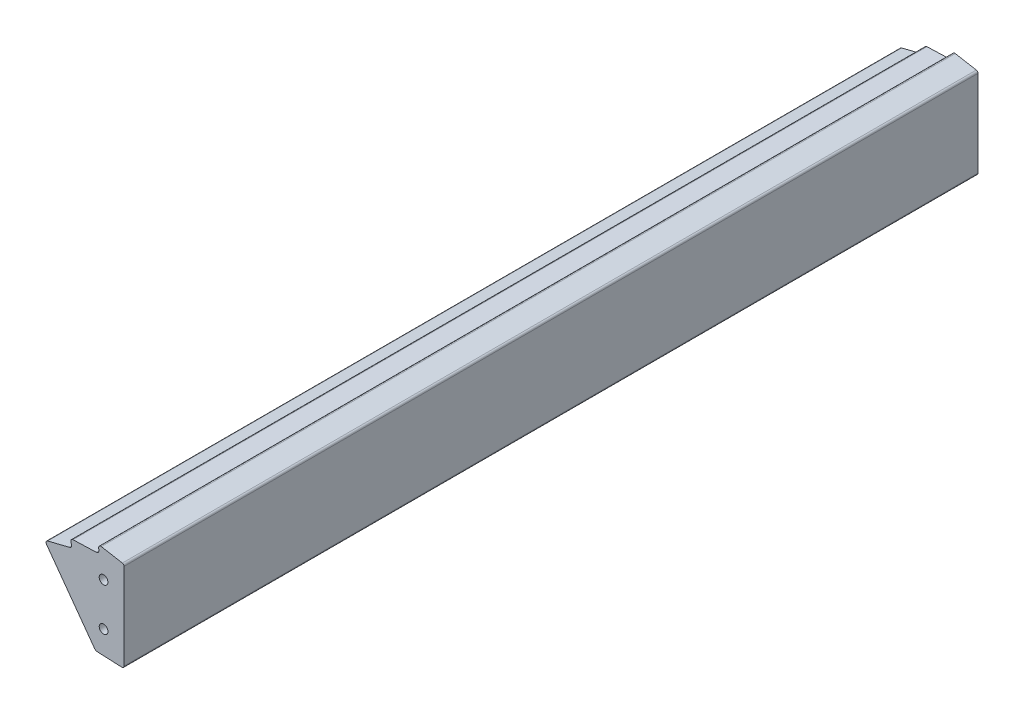
ISO-10303-21;
HEADER;
FILE_DESCRIPTION(('STEP AP214'),'2;1');
FILE_NAME('part.step','',(''),(''),'','','');
FILE_SCHEMA(('AUTOMOTIVE_DESIGN { 1 0 10303 214 1 1 1 1 }'));
ENDSEC;
DATA;
#1=APPLICATION_CONTEXT('core data for automotive mechanical design processes');
#2=APPLICATION_PROTOCOL_DEFINITION('international standard','automotive_design',2000,#1);
#3=PRODUCT_CONTEXT('',#1,'mechanical');
#4=PRODUCT('Part','Part','',(#3));
#5=PRODUCT_RELATED_PRODUCT_CATEGORY('part','',(#4));
#6=PRODUCT_DEFINITION_FORMATION('','',#4);
#7=PRODUCT_DEFINITION_CONTEXT('part definition',#1,'design');
#8=PRODUCT_DEFINITION('design','',#6,#7);
#9=PRODUCT_DEFINITION_SHAPE('','',#8);
#10=(LENGTH_UNIT() NAMED_UNIT(*) SI_UNIT(.MILLI.,.METRE.));
#11=(NAMED_UNIT(*) PLANE_ANGLE_UNIT() SI_UNIT($,.RADIAN.));
#12=(NAMED_UNIT(*) SI_UNIT($,.STERADIAN.) SOLID_ANGLE_UNIT());
#13=UNCERTAINTY_MEASURE_WITH_UNIT(LENGTH_MEASURE(1.E-05),#10,'distance_accuracy_value','');
#14=(GEOMETRIC_REPRESENTATION_CONTEXT(3) GLOBAL_UNCERTAINTY_ASSIGNED_CONTEXT((#13)) GLOBAL_UNIT_ASSIGNED_CONTEXT((#10,
#11,#12)) REPRESENTATION_CONTEXT('',''));
#15=CARTESIAN_POINT('',(0.,0.,0.));
#16=DIRECTION('',(0.,0.,1.));
#17=DIRECTION('',(1.,0.,0.));
#18=AXIS2_PLACEMENT_3D('',#15,#16,#17);
#19=CARTESIAN_POINT('',(-46.6812399998423,66.4118678141727,359.155968305537));
#20=DIRECTION('',(0.809016994374946,0.587785252292475,0.));
#21=DIRECTION('',(-0.587785252292475,0.809016994374946,0.));
#22=AXIS2_PLACEMENT_3D('',#19,#20,#21);
#23=PLANE('',#22);
#24=DIRECTION('',(0.587785252292475,-0.809016994374946,0.));
#25=VECTOR('',#24,1.);
#26=CARTESIAN_POINT('',(-46.6812399998423,66.4118678141727,212.000125));
#27=LINE('',#26,#25);
#28=CARTESIAN_POINT('',(-46.7307638456998,66.480031540243,212.000125));
#29=VERTEX_POINT('',#28);
#30=CARTESIAN_POINT('',(-18.5166557094704,27.6466431993184,212.000125));
#31=VERTEX_POINT('',#30);
#32=EDGE_CURVE('E453',#29,#31,#27,.T.);
#33=ORIENTED_EDGE('',*,*,#32,.F.);
#34=DIRECTION('',(0.,0.,-1.));
#35=VECTOR('',#34,1.);
#36=CARTESIAN_POINT('',(-46.7307638456998,66.480031540243,359.155968305537));
#37=LINE('',#36,#35);
#38=CARTESIAN_POINT('',(-46.7307638456998,66.480031540243,-287.999875));
#39=VERTEX_POINT('',#38);
#40=EDGE_CURVE('E455',#29,#39,#37,.T.);
#41=ORIENTED_EDGE('',*,*,#40,.T.);
#42=DIRECTION('',(-0.587785252292475,0.809016994374946,0.));
#43=VECTOR('',#42,1.);
#44=CARTESIAN_POINT('',(-46.6812399998423,66.4118678141727,-287.999875));
#45=LINE('',#44,#43);
#46=CARTESIAN_POINT('',(-18.5166557094704,27.6466431993184,-287.999875));
#47=VERTEX_POINT('',#46);
#48=EDGE_CURVE('E257',#47,#39,#45,.T.);
#49=ORIENTED_EDGE('',*,*,#48,.F.);
#50=DIRECTION('',(0.,0.,-1.));
#51=VECTOR('',#50,1.);
#52=CARTESIAN_POINT('',(-18.5166557094704,27.6466431993184,359.155968305537));
#53=LINE('',#52,#51);
#54=EDGE_CURVE('E456',#31,#47,#53,.T.);
#55=ORIENTED_EDGE('',*,*,#54,.F.);
#56=EDGE_LOOP('',(#33,#41,#49,#55));
#57=FACE_BOUND('',#56,.T.);
#58=ADVANCED_FACE('F243',(#57),#23,.F.);
#59=CARTESIAN_POINT('',(-16.8583921893543,28.8514421693227,359.155968305537));
#60=DIRECTION('',(0.,0.,-1.));
#61=DIRECTION('',(-1.,0.,0.));
#62=AXIS2_PLACEMENT_3D('',#59,#60,#61);
#63=CYLINDRICAL_SURFACE('',#62,2.04972643547161);
#64=CARTESIAN_POINT('',(-16.8583921893543,28.8514421693227,212.000125));
#65=DIRECTION('',(0.,0.,1.));
#66=DIRECTION('',(1.,0.,0.));
#67=AXIS2_PLACEMENT_3D('',#64,#65,#66);
#68=CIRCLE('',#67,2.04972643547161);
#69=CARTESIAN_POINT('',(-16.9515326959888,26.8038330009766,212.000125));
#70=VERTEX_POINT('',#69);
#71=EDGE_CURVE('E451',#31,#70,#68,.T.);
#72=ORIENTED_EDGE('',*,*,#71,.F.);
#73=ORIENTED_EDGE('',*,*,#54,.T.);
#74=CARTESIAN_POINT('',(-16.8583921893543,28.8514421693227,-287.999875));
#75=DIRECTION('',(0.,0.,-1.));
#76=DIRECTION('',(-1.,0.,0.));
#77=AXIS2_PLACEMENT_3D('',#74,#75,#76);
#78=CIRCLE('',#77,2.04972643547161);
#79=CARTESIAN_POINT('',(-16.9515326959888,26.8038330009766,-287.999875));
#80=VERTEX_POINT('',#79);
#81=EDGE_CURVE('E423',#80,#47,#78,.T.);
#82=ORIENTED_EDGE('',*,*,#81,.F.);
#83=DIRECTION('',(0.,0.,-1.));
#84=VECTOR('',#83,1.);
#85=CARTESIAN_POINT('',(-16.9515326959888,26.8038330009766,359.155968305537));
#86=LINE('',#85,#84);
#87=EDGE_CURVE('E459',#70,#80,#86,.T.);
#88=ORIENTED_EDGE('',*,*,#87,.F.);
#89=EDGE_LOOP('',(#72,#73,#82,#88));
#90=FACE_BOUND('',#89,.T.);
#91=ADVANCED_FACE('F519',(#90),#63,.T.);
#92=CARTESIAN_POINT('',(-16.9515326959888,26.8038330009766,359.155968305537));
#93=DIRECTION('',(0.0454404573325836,0.998967048924741,0.));
#94=DIRECTION('',(-0.998967048924741,0.0454404573325836,0.));
#95=AXIS2_PLACEMENT_3D('',#92,#93,#94);
#96=PLANE('',#95);
#97=DIRECTION('',(0.998967048924741,-0.0454404573325836,0.));
#98=VECTOR('',#97,1.);
#99=CARTESIAN_POINT('',(-16.9515326959888,26.8038330009766,212.000125));
#100=LINE('',#99,#98);
#101=CARTESIAN_POINT('',(-2.55589176251908,26.1490120954055,212.000125));
#102=VERTEX_POINT('',#101);
#103=EDGE_CURVE('E449',#70,#102,#100,.T.);
#104=ORIENTED_EDGE('',*,*,#103,.F.);
#105=ORIENTED_EDGE('',*,*,#87,.T.);
#106=DIRECTION('',(-0.998967048924741,0.0454404573325836,0.));
#107=VECTOR('',#106,1.);
#108=CARTESIAN_POINT('',(-16.9515326959888,26.8038330009766,-287.999875));
#109=LINE('',#108,#107);
#110=CARTESIAN_POINT('',(-2.55589176251908,26.1490120954055,-287.999875));
#111=VERTEX_POINT('',#110);
#112=EDGE_CURVE('E421',#111,#80,#109,.T.);
#113=ORIENTED_EDGE('',*,*,#112,.F.);
#114=DIRECTION('',(0.,0.,-1.));
#115=VECTOR('',#114,1.);
#116=CARTESIAN_POINT('',(-2.55589176251908,26.1490120954055,359.155968305537));
#117=LINE('',#116,#115);
#118=EDGE_CURVE('E462',#102,#111,#117,.T.);
#119=ORIENTED_EDGE('',*,*,#118,.F.);
#120=EDGE_LOOP('',(#104,#105,#113,#119));
#121=FACE_BOUND('',#120,.T.);
#122=ADVANCED_FACE('F525',(#121),#96,.F.);
#123=CARTESIAN_POINT('',(-2.5,27.377741565583,359.155968305537));
#124=DIRECTION('',(0.,0.,-1.));
#125=DIRECTION('',(-1.,0.,0.));
#126=AXIS2_PLACEMENT_3D('',#123,#124,#125);
#127=CYLINDRICAL_SURFACE('',#126,1.23);
#128=CARTESIAN_POINT('',(-2.5,27.377741565583,212.000125));
#129=DIRECTION('',(0.,0.,1.));
#130=DIRECTION('',(1.,0.,0.));
#131=AXIS2_PLACEMENT_3D('',#128,#129,#130);
#132=CIRCLE('',#131,1.23);
#133=CARTESIAN_POINT('',(-1.26999999999993,27.377741565583,212.000125));
#134=VERTEX_POINT('',#133);
#135=EDGE_CURVE('E447',#102,#134,#132,.T.);
#136=ORIENTED_EDGE('',*,*,#135,.F.);
#137=ORIENTED_EDGE('',*,*,#118,.T.);
#138=CARTESIAN_POINT('',(-2.5,27.377741565583,-287.999875));
#139=DIRECTION('',(0.,0.,-1.));
#140=DIRECTION('',(-1.,0.,0.));
#141=AXIS2_PLACEMENT_3D('',#138,#139,#140);
#142=CIRCLE('',#141,1.23);
#143=CARTESIAN_POINT('',(-1.26999999999993,27.377741565583,-287.999875));
#144=VERTEX_POINT('',#143);
#145=EDGE_CURVE('E419',#144,#111,#142,.T.);
#146=ORIENTED_EDGE('',*,*,#145,.F.);
#147=DIRECTION('',(0.,0.,-1.));
#148=VECTOR('',#147,1.);
#149=CARTESIAN_POINT('',(-1.27,27.377741565583,359.155968305537));
#150=LINE('',#149,#148);
#151=EDGE_CURVE('E465',#134,#144,#150,.T.);
#152=ORIENTED_EDGE('',*,*,#151,.F.);
#153=EDGE_LOOP('',(#136,#137,#146,#152));
#154=FACE_BOUND('',#153,.T.);
#155=ADVANCED_FACE('F529',(#154),#127,.T.);
#156=CARTESIAN_POINT('',(-1.27,77.950492711389,359.155968305537));
#157=DIRECTION('',(-1.,0.,0.));
#158=DIRECTION('',(0.,-1.,0.));
#159=AXIS2_PLACEMENT_3D('',#156,#157,#158);
#160=PLANE('',#159);
#161=DIRECTION('',(0.,1.,0.));
#162=VECTOR('',#161,1.);
#163=CARTESIAN_POINT('',(-1.27,77.950492711389,212.000125));
#164=LINE('',#163,#162);
#165=CARTESIAN_POINT('',(-1.27,77.950492711389,212.000125));
#166=VERTEX_POINT('',#165);
#167=EDGE_CURVE('E445',#134,#166,#164,.T.);
#168=ORIENTED_EDGE('',*,*,#167,.F.);
#169=ORIENTED_EDGE('',*,*,#151,.T.);
#170=DIRECTION('',(0.,-1.,0.));
#171=VECTOR('',#170,1.);
#172=CARTESIAN_POINT('',(-1.27,77.950492711389,-287.999875));
#173=LINE('',#172,#171);
#174=CARTESIAN_POINT('',(-1.27,77.950492711389,-287.999875));
#175=VERTEX_POINT('',#174);
#176=EDGE_CURVE('E417',#175,#144,#173,.T.);
#177=ORIENTED_EDGE('',*,*,#176,.F.);
#178=DIRECTION('',(0.,0.,-1.));
#179=VECTOR('',#178,1.);
#180=CARTESIAN_POINT('',(-1.27,77.950492711389,359.155968305537));
#181=LINE('',#180,#179);
#182=EDGE_CURVE('E468',#166,#175,#181,.T.);
#183=ORIENTED_EDGE('',*,*,#182,.F.);
#184=EDGE_LOOP('',(#168,#169,#177,#183));
#185=FACE_BOUND('',#184,.T.);
#186=ADVANCED_FACE('F535',(#185),#160,.F.);
#187=CARTESIAN_POINT('',(-2.47361650036887,77.950492711389,359.155968305537));
#188=DIRECTION('',(0.,0.,-1.));
#189=DIRECTION('',(-1.,0.,0.));
#190=AXIS2_PLACEMENT_3D('',#187,#188,#189);
#191=CYLINDRICAL_SURFACE('',#190,1.20361650036887);
#192=CARTESIAN_POINT('',(-2.47361650036887,77.950492711389,212.000125));
#193=DIRECTION('',(0.,0.,1.));
#194=DIRECTION('',(1.,0.,0.));
#195=AXIS2_PLACEMENT_3D('',#192,#193,#194);
#196=CIRCLE('',#195,1.20361650036887);
#197=CARTESIAN_POINT('',(-2.26384716902904,79.1356886899467,212.000125));
#198=VERTEX_POINT('',#197);
#199=EDGE_CURVE('E443',#166,#198,#196,.T.);
#200=ORIENTED_EDGE('',*,*,#199,.F.);
#201=ORIENTED_EDGE('',*,*,#182,.T.);
#202=CARTESIAN_POINT('',(-2.47361650036887,77.950492711389,-287.999875));
#203=DIRECTION('',(0.,0.,-1.));
#204=DIRECTION('',(-1.,0.,0.));
#205=AXIS2_PLACEMENT_3D('',#202,#203,#204);
#206=CIRCLE('',#205,1.20361650036887);
#207=CARTESIAN_POINT('',(-2.26384716902904,79.1356886899467,-287.999875));
#208=VERTEX_POINT('',#207);
#209=EDGE_CURVE('E415',#208,#175,#206,.T.);
#210=ORIENTED_EDGE('',*,*,#209,.F.);
#211=DIRECTION('',(0.,0.,-1.));
#212=VECTOR('',#211,1.);
#213=CARTESIAN_POINT('',(-2.26384716902904,79.1356886899467,359.155968305537));
#214=LINE('',#213,#212);
#215=EDGE_CURVE('E471',#198,#208,#214,.T.);
#216=ORIENTED_EDGE('',*,*,#215,.F.);
#217=EDGE_LOOP('',(#200,#201,#210,#216));
#218=FACE_BOUND('',#217,.T.);
#219=ADVANCED_FACE('F539',(#218),#191,.T.);
#220=CARTESIAN_POINT('',(-2.26384716902904,79.1356886899467,359.155968305537));
#221=DIRECTION('',(-0.174282532081888,-0.984695688530789,0.));
#222=DIRECTION('',(0.98469568853079,-0.174282532081888,0.));
#223=AXIS2_PLACEMENT_3D('',#220,#221,#222);
#224=PLANE('',#223);
#225=DIRECTION('',(-0.98469568853079,0.174282532081888,0.));
#226=VECTOR('',#225,1.);
#227=CARTESIAN_POINT('',(-2.26384716902904,79.1356886899467,212.000125));
#228=LINE('',#227,#226);
#229=CARTESIAN_POINT('',(-14.583974188352,81.3162435126268,212.000125));
#230=VERTEX_POINT('',#229);
#231=EDGE_CURVE('E441',#198,#230,#228,.T.);
#232=ORIENTED_EDGE('',*,*,#231,.F.);
#233=ORIENTED_EDGE('',*,*,#215,.T.);
#234=DIRECTION('',(0.98469568853079,-0.174282532081888,0.));
#235=VECTOR('',#234,1.);
#236=CARTESIAN_POINT('',(-2.26384716902904,79.1356886899467,-287.999875));
#237=LINE('',#236,#235);
#238=CARTESIAN_POINT('',(-14.583974188352,81.3162435126268,-287.999875));
#239=VERTEX_POINT('',#238);
#240=EDGE_CURVE('E413',#239,#208,#237,.T.);
#241=ORIENTED_EDGE('',*,*,#240,.F.);
#242=DIRECTION('',(0.,0.,-1.));
#243=VECTOR('',#242,1.);
#244=CARTESIAN_POINT('',(-14.583974188352,81.3162435126268,359.155968305537));
#245=LINE('',#244,#243);
#246=EDGE_CURVE('E474',#230,#239,#245,.T.);
#247=ORIENTED_EDGE('',*,*,#246,.F.);
#248=EDGE_LOOP('',(#232,#233,#241,#247));
#249=FACE_BOUND('',#248,.T.);
#250=ADVANCED_FACE('F545',(#249),#224,.F.);
#251=CARTESIAN_POINT('',(-14.820127019323,79.9819808546676,359.155968305537));
#252=DIRECTION('',(0.,0.,-1.));
#253=DIRECTION('',(-1.,0.,0.));
#254=AXIS2_PLACEMENT_3D('',#251,#252,#253);
#255=CYLINDRICAL_SURFACE('',#254,1.35499999999999);
#256=CARTESIAN_POINT('',(-14.820127019323,79.9819808546676,212.000125));
#257=DIRECTION('',(0.,0.,1.));
#258=DIRECTION('',(1.,0.,0.));
#259=AXIS2_PLACEMENT_3D('',#256,#257,#258);
#260=CIRCLE('',#259,1.35499999999999);
#261=CARTESIAN_POINT('',(-16.1476694187489,79.7105841381688,212.000125));
#262=VERTEX_POINT('',#261);
#263=EDGE_CURVE('E439',#230,#262,#260,.T.);
#264=ORIENTED_EDGE('',*,*,#263,.F.);
#265=ORIENTED_EDGE('',*,*,#246,.T.);
#266=CARTESIAN_POINT('',(-14.820127019323,79.9819808546676,-287.999875));
#267=DIRECTION('',(0.,0.,-1.));
#268=DIRECTION('',(-1.,0.,0.));
#269=AXIS2_PLACEMENT_3D('',#266,#267,#268);
#270=CIRCLE('',#269,1.35499999999999);
#271=CARTESIAN_POINT('',(-16.1476694187489,79.7105841381688,-287.999875));
#272=VERTEX_POINT('',#271);
#273=EDGE_CURVE('E411',#272,#239,#270,.T.);
#274=ORIENTED_EDGE('',*,*,#273,.F.);
#275=DIRECTION('',(0.,0.,-1.));
#276=VECTOR('',#275,1.);
#277=CARTESIAN_POINT('',(-16.1476694187489,79.7105841381688,359.155968305537));
#278=LINE('',#277,#276);
#279=EDGE_CURVE('E477',#262,#272,#278,.T.);
#280=ORIENTED_EDGE('',*,*,#279,.F.);
#281=EDGE_LOOP('',(#264,#265,#274,#280));
#282=FACE_BOUND('',#281,.T.);
#283=ADVANCED_FACE('F549',(#282),#255,.T.);
#284=CARTESIAN_POINT('',(-16.1476694187489,79.7105841381688,359.155968305537));
#285=DIRECTION('',(0.979736088137246,0.20029277970393,0.));
#286=DIRECTION('',(-0.200292779703931,0.979736088137246,0.));
#287=AXIS2_PLACEMENT_3D('',#284,#285,#286);
#288=PLANE('',#287);
#289=DIRECTION('',(0.200292779703931,-0.979736088137246,0.));
#290=VECTOR('',#289,1.);
#291=CARTESIAN_POINT('',(-16.1476694187489,79.7105841381688,212.000125));
#292=LINE('',#291,#290);
#293=CARTESIAN_POINT('',(-15.9916944411581,78.9476294544402,212.000125));
#294=VERTEX_POINT('',#293);
#295=EDGE_CURVE('E437',#262,#294,#292,.T.);
#296=ORIENTED_EDGE('',*,*,#295,.F.);
#297=ORIENTED_EDGE('',*,*,#279,.T.);
#298=DIRECTION('',(-0.200292779703931,0.979736088137246,0.));
#299=VECTOR('',#298,1.);
#300=CARTESIAN_POINT('',(-16.1476694187489,79.7105841381688,-287.999875));
#301=LINE('',#300,#299);
#302=CARTESIAN_POINT('',(-15.9916944411581,78.9476294544402,-287.999875));
#303=VERTEX_POINT('',#302);
#304=EDGE_CURVE('E409',#303,#272,#301,.T.);
#305=ORIENTED_EDGE('',*,*,#304,.F.);
#306=DIRECTION('',(0.,0.,-1.));
#307=VECTOR('',#306,1.);
#308=CARTESIAN_POINT('',(-15.9916944411581,78.9476294544402,359.155968305537));
#309=LINE('',#308,#307);
#310=EDGE_CURVE('E480',#294,#303,#309,.T.);
#311=ORIENTED_EDGE('',*,*,#310,.F.);
#312=EDGE_LOOP('',(#296,#297,#305,#311));
#313=FACE_BOUND('',#312,.T.);
#314=ADVANCED_FACE('F555',(#313),#288,.F.);
#315=CARTESIAN_POINT('',(-17.6033603061439,78.6181478318272,359.155968305537));
#316=DIRECTION('',(0.,0.,-1.));
#317=DIRECTION('',(-1.,0.,0.));
#318=AXIS2_PLACEMENT_3D('',#315,#316,#317);
#319=CYLINDRICAL_SURFACE('',#318,1.645);
#320=CARTESIAN_POINT('',(-17.6033603061439,78.6181478318272,212.000125));
#321=DIRECTION('',(0.,0.,1.));
#322=DIRECTION('',(1.,0.,0.));
#323=AXIS2_PLACEMENT_3D('',#320,#321,#322);
#324=CIRCLE('',#323,1.645);
#325=CARTESIAN_POINT('',(-17.5470096715214,76.9741132804939,212.000125));
#326=VERTEX_POINT('',#325);
#327=EDGE_CURVE('E435',#294,#326,#324,.F.);
#328=ORIENTED_EDGE('',*,*,#327,.F.);
#329=ORIENTED_EDGE('',*,*,#310,.T.);
#330=CARTESIAN_POINT('',(-17.6033603061439,78.6181478318272,-287.999875));
#331=DIRECTION('',(0.,0.,-1.));
#332=DIRECTION('',(-1.,0.,0.));
#333=AXIS2_PLACEMENT_3D('',#330,#331,#332);
#334=CIRCLE('',#333,1.645);
#335=CARTESIAN_POINT('',(-17.5470096715214,76.9741132804939,-287.999875));
#336=VERTEX_POINT('',#335);
#337=EDGE_CURVE('E407',#336,#303,#334,.F.);
#338=ORIENTED_EDGE('',*,*,#337,.F.);
#339=DIRECTION('',(0.,0.,-1.));
#340=VECTOR('',#339,1.);
#341=CARTESIAN_POINT('',(-17.5470096715214,76.9741132804939,359.155968305537));
#342=LINE('',#341,#340);
#343=EDGE_CURVE('E483',#326,#336,#342,.T.);
#344=ORIENTED_EDGE('',*,*,#343,.F.);
#345=EDGE_LOOP('',(#328,#329,#338,#344));
#346=FACE_BOUND('',#345,.T.);
#347=ADVANCED_FACE('F559',(#346),#319,.F.);
#348=CARTESIAN_POINT('',(-17.5470096715214,76.9741132804939,359.155968305537));
#349=DIRECTION('',(0.0342557049376829,-0.99941310111446,0.));
#350=DIRECTION('',(0.99941310111446,0.0342557049376829,0.));
#351=AXIS2_PLACEMENT_3D('',#348,#349,#350);
#352=PLANE('',#351);
#353=DIRECTION('',(-0.99941310111446,-0.0342557049376829,0.));
#354=VECTOR('',#353,1.);
#355=CARTESIAN_POINT('',(-17.5470096715214,76.9741132804939,212.000125));
#356=LINE('',#355,#354);
#357=CARTESIAN_POINT('',(-31.1718770411592,76.507109760219,212.000125));
#358=VERTEX_POINT('',#357);
#359=EDGE_CURVE('E433',#326,#358,#356,.T.);
#360=ORIENTED_EDGE('',*,*,#359,.F.);
#361=ORIENTED_EDGE('',*,*,#343,.T.);
#362=DIRECTION('',(0.99941310111446,0.0342557049376829,0.));
#363=VECTOR('',#362,1.);
#364=CARTESIAN_POINT('',(-17.5470096715214,76.9741132804939,-287.999875));
#365=LINE('',#364,#363);
#366=CARTESIAN_POINT('',(-31.1718770411592,76.507109760219,-287.999875));
#367=VERTEX_POINT('',#366);
#368=EDGE_CURVE('E405',#367,#336,#365,.T.);
#369=ORIENTED_EDGE('',*,*,#368,.F.);
#370=DIRECTION('',(0.,0.,-1.));
#371=VECTOR('',#370,1.);
#372=CARTESIAN_POINT('',(-31.1718770411592,76.507109760219,359.155968305537));
#373=LINE('',#372,#371);
#374=EDGE_CURVE('E486',#358,#367,#373,.T.);
#375=ORIENTED_EDGE('',*,*,#374,.F.);
#376=EDGE_LOOP('',(#360,#361,#369,#375));
#377=FACE_BOUND('',#376,.T.);
#378=ADVANCED_FACE('F565',(#377),#352,.F.);
#379=CARTESIAN_POINT('',(-31.1254605609687,75.1529050082089,359.155968305537));
#380=DIRECTION('',(0.,0.,-1.));
#381=DIRECTION('',(-1.,0.,0.));
#382=AXIS2_PLACEMENT_3D('',#379,#380,#381);
#383=CYLINDRICAL_SURFACE('',#382,1.35500000000001);
#384=CARTESIAN_POINT('',(-31.1254605609687,75.1529050082089,212.000125));
#385=DIRECTION('',(0.,0.,1.));
#386=DIRECTION('',(1.,0.,0.));
#387=AXIS2_PLACEMENT_3D('',#384,#385,#386);
#388=CIRCLE('',#387,1.35500000000001);
#389=CARTESIAN_POINT('',(-32.3675664236299,74.6114273762216,212.000125));
#390=VERTEX_POINT('',#389);
#391=EDGE_CURVE('E431',#358,#390,#388,.T.);
#392=ORIENTED_EDGE('',*,*,#391,.F.);
#393=ORIENTED_EDGE('',*,*,#374,.T.);
#394=CARTESIAN_POINT('',(-31.1254605609687,75.1529050082089,-287.999875));
#395=DIRECTION('',(0.,0.,-1.));
#396=DIRECTION('',(-1.,0.,0.));
#397=AXIS2_PLACEMENT_3D('',#394,#395,#396);
#398=CIRCLE('',#397,1.35500000000001);
#399=CARTESIAN_POINT('',(-32.3675664236299,74.6114273762216,-287.999875));
#400=VERTEX_POINT('',#399);
#401=EDGE_CURVE('E403',#400,#367,#398,.T.);
#402=ORIENTED_EDGE('',*,*,#401,.F.);
#403=DIRECTION('',(0.,0.,-1.));
#404=VECTOR('',#403,1.);
#405=CARTESIAN_POINT('',(-32.3675664236299,74.6114273762216,359.155968305537));
#406=LINE('',#405,#404);
#407=EDGE_CURVE('E489',#390,#400,#406,.T.);
#408=ORIENTED_EDGE('',*,*,#407,.F.);
#409=EDGE_LOOP('',(#392,#393,#402,#408));
#410=FACE_BOUND('',#409,.T.);
#411=ADVANCED_FACE('F569',(#410),#383,.T.);
#412=CARTESIAN_POINT('',(-32.3675664236299,74.6114273762216,359.155968305537));
#413=DIRECTION('',(0.916683293476933,0.399614488551507,0.));
#414=DIRECTION('',(-0.399614488551507,0.916683293476933,0.));
#415=AXIS2_PLACEMENT_3D('',#412,#413,#414);
#416=PLANE('',#415);
#417=DIRECTION('',(0.399614488551507,-0.916683293476933,0.));
#418=VECTOR('',#417,1.);
#419=CARTESIAN_POINT('',(-32.3675664236299,74.6114273762216,212.000125));
#420=LINE('',#419,#418);
#421=CARTESIAN_POINT('',(-32.0563726752136,73.89757410418,212.000125));
#422=VERTEX_POINT('',#421);
#423=EDGE_CURVE('E429',#390,#422,#420,.T.);
#424=ORIENTED_EDGE('',*,*,#423,.F.);
#425=ORIENTED_EDGE('',*,*,#407,.T.);
#426=DIRECTION('',(-0.399614488551507,0.916683293476933,0.));
#427=VECTOR('',#426,1.);
#428=CARTESIAN_POINT('',(-32.3675664236299,74.6114273762216,-287.999875));
#429=LINE('',#428,#427);
#430=CARTESIAN_POINT('',(-32.0563726752136,73.89757410418,-287.999875));
#431=VERTEX_POINT('',#430);
#432=EDGE_CURVE('E401',#431,#400,#429,.T.);
#433=ORIENTED_EDGE('',*,*,#432,.F.);
#434=DIRECTION('',(0.,0.,-1.));
#435=VECTOR('',#434,1.);
#436=CARTESIAN_POINT('',(-32.0563726752136,73.89757410418,359.155968305537));
#437=LINE('',#436,#435);
#438=EDGE_CURVE('E492',#422,#431,#437,.T.);
#439=ORIENTED_EDGE('',*,*,#438,.F.);
#440=EDGE_LOOP('',(#424,#425,#433,#439));
#441=FACE_BOUND('',#440,.T.);
#442=ADVANCED_FACE('F575',(#441),#416,.F.);
#443=CARTESIAN_POINT('',(-33.5643166929831,73.2402082705128,359.155968305537));
#444=DIRECTION('',(0.,0.,-1.));
#445=DIRECTION('',(-1.,0.,0.));
#446=AXIS2_PLACEMENT_3D('',#443,#444,#445);
#447=CYLINDRICAL_SURFACE('',#446,1.645);
#448=CARTESIAN_POINT('',(-33.5643166929831,73.2402082705128,212.000125));
#449=DIRECTION('',(0.,0.,1.));
#450=DIRECTION('',(1.,0.,0.));
#451=AXIS2_PLACEMENT_3D('',#448,#449,#450);
#452=CIRCLE('',#451,1.645);
#453=CARTESIAN_POINT('',(-33.1673834515968,71.6438157743257,212.000125));
#454=VERTEX_POINT('',#453);
#455=EDGE_CURVE('E427',#422,#454,#452,.F.);
#456=ORIENTED_EDGE('',*,*,#455,.F.);
#457=ORIENTED_EDGE('',*,*,#438,.T.);
#458=CARTESIAN_POINT('',(-33.5643166929831,73.2402082705128,-287.999875));
#459=DIRECTION('',(0.,0.,-1.));
#460=DIRECTION('',(-1.,0.,0.));
#461=AXIS2_PLACEMENT_3D('',#458,#459,#460);
#462=CIRCLE('',#461,1.645);
#463=CARTESIAN_POINT('',(-33.1673834515968,71.6438157743257,-287.999875));
#464=VERTEX_POINT('',#463);
#465=EDGE_CURVE('E399',#464,#431,#462,.F.);
#466=ORIENTED_EDGE('',*,*,#465,.F.);
#467=DIRECTION('',(0.,0.,-1.));
#468=VECTOR('',#467,1.);
#469=CARTESIAN_POINT('',(-33.1673834515968,71.6438157743257,359.155968305537));
#470=LINE('',#469,#468);
#471=EDGE_CURVE('E495',#454,#464,#470,.T.);
#472=ORIENTED_EDGE('',*,*,#471,.F.);
#473=EDGE_LOOP('',(#456,#457,#466,#472));
#474=FACE_BOUND('',#473,.T.);
#475=ADVANCED_FACE('F578',(#474),#447,.F.);
#476=CARTESIAN_POINT('',(-33.1673834515968,71.6438157743257,359.155968305537));
#477=DIRECTION('',(0.241296803274369,-0.970451365463293,0.));
#478=DIRECTION('',(0.970451365463293,0.241296803274369,0.));
#479=AXIS2_PLACEMENT_3D('',#476,#477,#478);
#480=PLANE('',#479);
#481=DIRECTION('',(-0.970451365463293,-0.241296803274369,0.));
#482=VECTOR('',#481,1.);
#483=CARTESIAN_POINT('',(-33.1673834515968,71.6438157743257,212.000125));
#484=LINE('',#483,#482);
#485=CARTESIAN_POINT('',(-46.0131062651979,68.4498052746951,212.000125));
#486=VERTEX_POINT('',#485);
#487=EDGE_CURVE('E264',#454,#486,#484,.T.);
#488=ORIENTED_EDGE('',*,*,#487,.F.);
#489=ORIENTED_EDGE('',*,*,#471,.T.);
#490=DIRECTION('',(0.970451365463293,0.241296803274369,0.));
#491=VECTOR('',#490,1.);
#492=CARTESIAN_POINT('',(-33.1673834515968,71.6438157743257,-287.999875));
#493=LINE('',#492,#491);
#494=CARTESIAN_POINT('',(-46.0131062651979,68.4498052746951,-287.999875));
#495=VERTEX_POINT('',#494);
#496=EDGE_CURVE('E397',#495,#464,#493,.T.);
#497=ORIENTED_EDGE('',*,*,#496,.F.);
#498=DIRECTION('',(0.,0.,-1.));
#499=VECTOR('',#498,1.);
#500=CARTESIAN_POINT('',(-46.0131062651979,68.4498052746951,359.155968305537));
#501=LINE('',#500,#499);
#502=EDGE_CURVE('E498',#486,#495,#501,.T.);
#503=ORIENTED_EDGE('',*,*,#502,.F.);
#504=EDGE_LOOP('',(#488,#489,#497,#503));
#505=FACE_BOUND('',#504,.T.);
#506=ADVANCED_FACE('F509',(#505),#480,.F.);
#507=CARTESIAN_POINT('',(-45.7080819191639,67.2230534524938,359.155968305537));
#508=DIRECTION('',(0.,0.,-1.));
#509=DIRECTION('',(-1.,0.,0.));
#510=AXIS2_PLACEMENT_3D('',#507,#508,#509);
#511=CYLINDRICAL_SURFACE('',#510,1.26410438055874);
#512=ORIENTED_EDGE('',*,*,#40,.F.);
#513=CARTESIAN_POINT('',(-45.7080819191639,67.2230534524938,212.000125));
#514=DIRECTION('',(0.,0.,1.));
#515=DIRECTION('',(1.,0.,0.));
#516=AXIS2_PLACEMENT_3D('',#513,#514,#515);
#517=CIRCLE('',#516,1.26410438055874);
#518=EDGE_CURVE('E15',#486,#29,#517,.T.);
#519=ORIENTED_EDGE('',*,*,#518,.F.);
#520=ORIENTED_EDGE('',*,*,#502,.T.);
#521=CARTESIAN_POINT('',(-45.7080819191639,67.2230534524938,-287.999875));
#522=DIRECTION('',(0.,0.,-1.));
#523=DIRECTION('',(-1.,0.,0.));
#524=AXIS2_PLACEMENT_3D('',#521,#522,#523);
#525=CIRCLE('',#524,1.26410438055874);
#526=EDGE_CURVE('E250',#39,#495,#525,.T.);
#527=ORIENTED_EDGE('',*,*,#526,.F.);
#528=EDGE_LOOP('',(#512,#519,#520,#527));
#529=FACE_BOUND('',#528,.T.);
#530=ADVANCED_FACE('F511',(#529),#511,.T.);
#531=CARTESIAN_POINT('',(-46.9721862997227,102.664117138486,-287.999875));
#532=DIRECTION('',(0.,0.,-1.));
#533=DIRECTION('',(-1.,0.,0.));
#534=AXIS2_PLACEMENT_3D('',#531,#532,#533);
#535=PLANE('',#534);
#536=CARTESIAN_POINT('',(-13.2699999999999,65.164117138486,-287.999875));
#537=DIRECTION('',(0.,0.,-1.));
#538=DIRECTION('',(-1.,0.,0.));
#539=AXIS2_PLACEMENT_3D('',#536,#537,#538);
#540=CIRCLE('',#539,2.5527);
#541=CARTESIAN_POINT('',(-15.8226999999999,65.164117138486,-287.999875));
#542=VERTEX_POINT('',#541);
#543=EDGE_CURVE('E385',#542,#542,#540,.T.);
#544=ORIENTED_EDGE('',*,*,#543,.F.);
#545=EDGE_LOOP('',(#544));
#546=FACE_BOUND('',#545,.T.);
#547=CARTESIAN_POINT('',(-13.2699999999999,40.164117138486,-287.999875));
#548=DIRECTION('',(0.,0.,-1.));
#549=DIRECTION('',(-1.,0.,0.));
#550=AXIS2_PLACEMENT_3D('',#547,#548,#549);
#551=CIRCLE('',#550,2.5527);
#552=CARTESIAN_POINT('',(-15.8226999999999,40.164117138486,-287.999875));
#553=VERTEX_POINT('',#552);
#554=EDGE_CURVE('E391',#553,#553,#551,.T.);
#555=ORIENTED_EDGE('',*,*,#554,.F.);
#556=EDGE_LOOP('',(#555));
#557=FACE_BOUND('',#556,.T.);
#558=ORIENTED_EDGE('',*,*,#48,.T.);
#559=ORIENTED_EDGE('',*,*,#526,.T.);
#560=ORIENTED_EDGE('',*,*,#496,.T.);
#561=ORIENTED_EDGE('',*,*,#465,.T.);
#562=ORIENTED_EDGE('',*,*,#432,.T.);
#563=ORIENTED_EDGE('',*,*,#401,.T.);
#564=ORIENTED_EDGE('',*,*,#368,.T.);
#565=ORIENTED_EDGE('',*,*,#337,.T.);
#566=ORIENTED_EDGE('',*,*,#304,.T.);
#567=ORIENTED_EDGE('',*,*,#273,.T.);
#568=ORIENTED_EDGE('',*,*,#240,.T.);
#569=ORIENTED_EDGE('',*,*,#209,.T.);
#570=ORIENTED_EDGE('',*,*,#176,.T.);
#571=ORIENTED_EDGE('',*,*,#145,.T.);
#572=ORIENTED_EDGE('',*,*,#112,.T.);
#573=ORIENTED_EDGE('',*,*,#81,.T.);
#574=EDGE_LOOP('',(#558,#559,#560,#561,#562,#563,#564,#565,#566,#567,#568,#569,#570,#571,#572,#573));
#575=FACE_BOUND('',#574,.T.);
#576=ADVANCED_FACE('F503',(#546,#557,#575),#535,.T.);
#577=CARTESIAN_POINT('',(-46.9721862997227,102.664117138486,212.000125));
#578=DIRECTION('',(0.,0.,1.));
#579=DIRECTION('',(1.,0.,0.));
#580=AXIS2_PLACEMENT_3D('',#577,#578,#579);
#581=PLANE('',#580);
#582=CARTESIAN_POINT('',(-13.2699999999999,65.1641171384861,212.000125));
#583=DIRECTION('',(0.,0.,1.));
#584=DIRECTION('',(1.,0.,0.));
#585=AXIS2_PLACEMENT_3D('',#582,#583,#584);
#586=CIRCLE('',#585,2.5527);
#587=CARTESIAN_POINT('',(-10.7172999999999,65.1641171384861,212.000125));
#588=VERTEX_POINT('',#587);
#589=EDGE_CURVE('E375',#588,#588,#586,.T.);
#590=ORIENTED_EDGE('',*,*,#589,.F.);
#591=EDGE_LOOP('',(#590));
#592=FACE_BOUND('',#591,.T.);
#593=CARTESIAN_POINT('',(-13.2699999999999,40.1641171384861,212.000125));
#594=DIRECTION('',(0.,0.,1.));
#595=DIRECTION('',(1.,0.,0.));
#596=AXIS2_PLACEMENT_3D('',#593,#594,#595);
#597=CIRCLE('',#596,2.5527);
#598=CARTESIAN_POINT('',(-10.7172999999999,40.1641171384861,212.000125));
#599=VERTEX_POINT('',#598);
#600=EDGE_CURVE('E374',#599,#599,#597,.T.);
#601=ORIENTED_EDGE('',*,*,#600,.F.);
#602=EDGE_LOOP('',(#601));
#603=FACE_BOUND('',#602,.T.);
#604=ORIENTED_EDGE('',*,*,#32,.T.);
#605=ORIENTED_EDGE('',*,*,#71,.T.);
#606=ORIENTED_EDGE('',*,*,#103,.T.);
#607=ORIENTED_EDGE('',*,*,#135,.T.);
#608=ORIENTED_EDGE('',*,*,#167,.T.);
#609=ORIENTED_EDGE('',*,*,#199,.T.);
#610=ORIENTED_EDGE('',*,*,#231,.T.);
#611=ORIENTED_EDGE('',*,*,#263,.T.);
#612=ORIENTED_EDGE('',*,*,#295,.T.);
#613=ORIENTED_EDGE('',*,*,#327,.T.);
#614=ORIENTED_EDGE('',*,*,#359,.T.);
#615=ORIENTED_EDGE('',*,*,#391,.T.);
#616=ORIENTED_EDGE('',*,*,#423,.T.);
#617=ORIENTED_EDGE('',*,*,#455,.T.);
#618=ORIENTED_EDGE('',*,*,#487,.T.);
#619=ORIENTED_EDGE('',*,*,#518,.T.);
#620=EDGE_LOOP('',(#604,#605,#606,#607,#608,#609,#610,#611,#612,#613,#614,#615,#616,#617,#618,#619));
#621=FACE_BOUND('',#620,.T.);
#622=ADVANCED_FACE('F513',(#592,#603,#621),#581,.T.);
#623=CARTESIAN_POINT('',(-13.2699999999999,40.164117138486,-271.489875));
#624=DIRECTION('',(0.,0.,-1.));
#625=DIRECTION('',(-1.,0.,0.));
#626=AXIS2_PLACEMENT_3D('',#623,#624,#625);
#627=CONICAL_SURFACE('',#626,2.5527,1.02974425867666);
#628=CARTESIAN_POINT('',(-13.2699999999999,40.164117138486,-269.956058097808));
#629=VERTEX_POINT('',#628);
#630=VERTEX_LOOP('',#629);
#631=FACE_BOUND('',#630,.T.);
#632=CARTESIAN_POINT('',(-13.2699999999999,40.164117138486,-271.489875));
#633=DIRECTION('',(0.,0.,-1.));
#634=DIRECTION('',(-1.,0.,0.));
#635=AXIS2_PLACEMENT_3D('',#632,#633,#634);
#636=CIRCLE('',#635,2.5527);
#637=CARTESIAN_POINT('',(-15.8226999999999,40.164117138486,-271.489875));
#638=VERTEX_POINT('',#637);
#639=EDGE_CURVE('E394',#638,#638,#636,.T.);
#640=ORIENTED_EDGE('',*,*,#639,.T.);
#641=EDGE_LOOP('',(#640));
#642=FACE_BOUND('',#641,.T.);
#643=ADVANCED_FACE('F658',(#631,#642),#627,.F.);
#644=CARTESIAN_POINT('',(-13.2699999999999,40.164117138486,-287.999875));
#645=DIRECTION('',(0.,0.,-1.));
#646=DIRECTION('',(-1.,0.,0.));
#647=AXIS2_PLACEMENT_3D('',#644,#645,#646);
#648=CYLINDRICAL_SURFACE('',#647,2.5527);
#649=ORIENTED_EDGE('',*,*,#639,.F.);
#650=EDGE_LOOP('',(#649));
#651=FACE_BOUND('',#650,.T.);
#652=ORIENTED_EDGE('',*,*,#554,.T.);
#653=EDGE_LOOP('',(#652));
#654=FACE_BOUND('',#653,.T.);
#655=ADVANCED_FACE('F668',(#651,#654),#648,.F.);
#656=CARTESIAN_POINT('',(-13.2699999999999,65.164117138486,-271.489875));
#657=DIRECTION('',(0.,0.,-1.));
#658=DIRECTION('',(-1.,0.,0.));
#659=AXIS2_PLACEMENT_3D('',#656,#657,#658);
#660=CONICAL_SURFACE('',#659,2.5527,1.02974425867666);
#661=CARTESIAN_POINT('',(-13.2699999999999,65.164117138486,-269.956058097808));
#662=VERTEX_POINT('',#661);
#663=VERTEX_LOOP('',#662);
#664=FACE_BOUND('',#663,.T.);
#665=CARTESIAN_POINT('',(-13.2699999999999,65.164117138486,-271.489875));
#666=DIRECTION('',(0.,0.,-1.));
#667=DIRECTION('',(-1.,0.,0.));
#668=AXIS2_PLACEMENT_3D('',#665,#666,#667);
#669=CIRCLE('',#668,2.5527);
#670=CARTESIAN_POINT('',(-15.8226999999999,65.164117138486,-271.489875));
#671=VERTEX_POINT('',#670);
#672=EDGE_CURVE('E388',#671,#671,#669,.T.);
#673=ORIENTED_EDGE('',*,*,#672,.T.);
#674=EDGE_LOOP('',(#673));
#675=FACE_BOUND('',#674,.T.);
#676=ADVANCED_FACE('F679',(#664,#675),#660,.F.);
#677=CARTESIAN_POINT('',(-13.2699999999999,65.164117138486,-287.999875));
#678=DIRECTION('',(0.,0.,-1.));
#679=DIRECTION('',(-1.,0.,0.));
#680=AXIS2_PLACEMENT_3D('',#677,#678,#679);
#681=CYLINDRICAL_SURFACE('',#680,2.5527);
#682=ORIENTED_EDGE('',*,*,#672,.F.);
#683=EDGE_LOOP('',(#682));
#684=FACE_BOUND('',#683,.T.);
#685=ORIENTED_EDGE('',*,*,#543,.T.);
#686=EDGE_LOOP('',(#685));
#687=FACE_BOUND('',#686,.T.);
#688=ADVANCED_FACE('F691',(#684,#687),#681,.F.);
#689=CARTESIAN_POINT('',(-13.2699999999999,40.1641171384861,195.490125));
#690=DIRECTION('',(0.,0.,1.));
#691=DIRECTION('',(1.,0.,0.));
#692=AXIS2_PLACEMENT_3D('',#689,#690,#691);
#693=CONICAL_SURFACE('',#692,2.5527,1.02974425867665);
#694=CARTESIAN_POINT('',(-13.2699999999999,40.1641171384861,193.956308097808));
#695=VERTEX_POINT('',#694);
#696=VERTEX_LOOP('',#695);
#697=FACE_BOUND('',#696,.T.);
#698=CARTESIAN_POINT('',(-13.2699999999999,40.1641171384861,195.490125));
#699=DIRECTION('',(0.,0.,1.));
#700=DIRECTION('',(1.,0.,0.));
#701=AXIS2_PLACEMENT_3D('',#698,#699,#700);
#702=CIRCLE('',#701,2.5527);
#703=CARTESIAN_POINT('',(-10.7172999999999,40.1641171384861,195.490125));
#704=VERTEX_POINT('',#703);
#705=EDGE_CURVE('E378',#704,#704,#702,.T.);
#706=ORIENTED_EDGE('',*,*,#705,.T.);
#707=EDGE_LOOP('',(#706));
#708=FACE_BOUND('',#707,.T.);
#709=ADVANCED_FACE('F701',(#697,#708),#693,.F.);
#710=CARTESIAN_POINT('',(-13.2699999999999,40.1641171384861,212.000125));
#711=DIRECTION('',(0.,0.,1.));
#712=DIRECTION('',(1.,0.,0.));
#713=AXIS2_PLACEMENT_3D('',#710,#711,#712);
#714=CYLINDRICAL_SURFACE('',#713,2.5527);
#715=ORIENTED_EDGE('',*,*,#705,.F.);
#716=EDGE_LOOP('',(#715));
#717=FACE_BOUND('',#716,.T.);
#718=ORIENTED_EDGE('',*,*,#600,.T.);
#719=EDGE_LOOP('',(#718));
#720=FACE_BOUND('',#719,.T.);
#721=ADVANCED_FACE('F368',(#717,#720),#714,.F.);
#722=CARTESIAN_POINT('',(-13.2699999999999,65.1641171384861,195.490125));
#723=DIRECTION('',(0.,0.,1.));
#724=DIRECTION('',(1.,0.,0.));
#725=AXIS2_PLACEMENT_3D('',#722,#723,#724);
#726=CONICAL_SURFACE('',#725,2.5527,1.02974425867665);
#727=CARTESIAN_POINT('',(-13.2699999999999,65.1641171384861,193.956308097808));
#728=VERTEX_POINT('',#727);
#729=VERTEX_LOOP('',#728);
#730=FACE_BOUND('',#729,.T.);
#731=CARTESIAN_POINT('',(-13.2699999999999,65.1641171384861,195.490125));
#732=DIRECTION('',(0.,0.,1.));
#733=DIRECTION('',(1.,0.,0.));
#734=AXIS2_PLACEMENT_3D('',#731,#732,#733);
#735=CIRCLE('',#734,2.5527);
#736=CARTESIAN_POINT('',(-10.7172999999999,65.1641171384861,195.490125));
#737=VERTEX_POINT('',#736);
#738=EDGE_CURVE('E372',#737,#737,#735,.T.);
#739=ORIENTED_EDGE('',*,*,#738,.T.);
#740=EDGE_LOOP('',(#739));
#741=FACE_BOUND('',#740,.T.);
#742=ADVANCED_FACE('F364',(#730,#741),#726,.F.);
#743=CARTESIAN_POINT('',(-13.2699999999999,65.1641171384861,212.000125));
#744=DIRECTION('',(0.,0.,1.));
#745=DIRECTION('',(1.,0.,0.));
#746=AXIS2_PLACEMENT_3D('',#743,#744,#745);
#747=CYLINDRICAL_SURFACE('',#746,2.5527);
#748=ORIENTED_EDGE('',*,*,#738,.F.);
#749=EDGE_LOOP('',(#748));
#750=FACE_BOUND('',#749,.T.);
#751=ORIENTED_EDGE('',*,*,#589,.T.);
#752=EDGE_LOOP('',(#751));
#753=FACE_BOUND('',#752,.T.);
#754=ADVANCED_FACE('F367',(#750,#753),#747,.F.);
#755=CLOSED_SHELL('',(#58,#91,#122,#155,#186,#219,#250,#283,#314,#347,#378,#411,#442,#475,#506,
#530,#576,#622,#643,#655,#676,#688,#709,#721,#742,#754));
#756=MANIFOLD_SOLID_BREP('B2',#755);
#757=ADVANCED_BREP_SHAPE_REPRESENTATION('',(#18,#756),#14);
#758=SHAPE_DEFINITION_REPRESENTATION(#9,#757);
ENDSEC;
END-ISO-10303-21;
